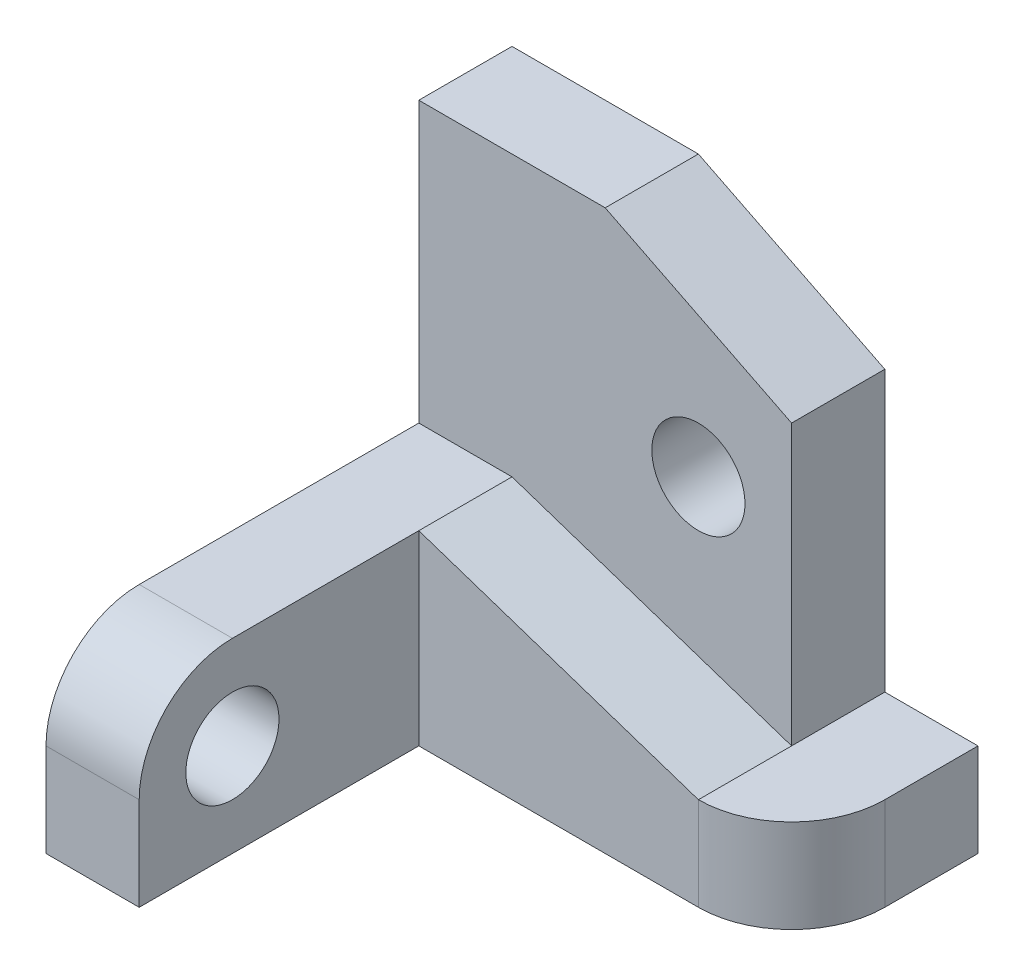
ISO-10303-21;
HEADER;
FILE_DESCRIPTION(('STEP AP214'),'2;1');
FILE_NAME('part.step','',(''),(''),'','','');
FILE_SCHEMA(('AUTOMOTIVE_DESIGN { 1 0 10303 214 1 1 1 1 }'));
ENDSEC;
DATA;
#1=APPLICATION_CONTEXT('core data for automotive mechanical design processes');
#2=APPLICATION_PROTOCOL_DEFINITION('international standard','automotive_design',2000,#1);
#3=PRODUCT_CONTEXT('',#1,'mechanical');
#4=PRODUCT('Part','Part','',(#3));
#5=PRODUCT_RELATED_PRODUCT_CATEGORY('part','',(#4));
#6=PRODUCT_DEFINITION_FORMATION('','',#4);
#7=PRODUCT_DEFINITION_CONTEXT('part definition',#1,'design');
#8=PRODUCT_DEFINITION('design','',#6,#7);
#9=PRODUCT_DEFINITION_SHAPE('','',#8);
#10=(LENGTH_UNIT() NAMED_UNIT(*) SI_UNIT(.MILLI.,.METRE.));
#11=(NAMED_UNIT(*) PLANE_ANGLE_UNIT() SI_UNIT($,.RADIAN.));
#12=(NAMED_UNIT(*) SI_UNIT($,.STERADIAN.) SOLID_ANGLE_UNIT());
#13=UNCERTAINTY_MEASURE_WITH_UNIT(LENGTH_MEASURE(1.E-05),#10,'distance_accuracy_value','');
#14=(GEOMETRIC_REPRESENTATION_CONTEXT(3) GLOBAL_UNCERTAINTY_ASSIGNED_CONTEXT((#13)) GLOBAL_UNIT_ASSIGNED_CONTEXT((#10,
#11,#12)) REPRESENTATION_CONTEXT('',''));
#15=CARTESIAN_POINT('',(0.,0.,0.));
#16=DIRECTION('',(0.,0.,1.));
#17=DIRECTION('',(1.,0.,0.));
#18=AXIS2_PLACEMENT_3D('',#15,#16,#17);
#19=CARTESIAN_POINT('',(11.147352147733,8.88294238199023,-3.26230276211233));
#20=DIRECTION('',(1.,0.,0.));
#21=DIRECTION('',(0.,0.,-1.));
#22=AXIS2_PLACEMENT_3D('',#19,#20,#21);
#23=PLANE('',#22);
#24=DIRECTION('',(0.,-1.,0.));
#25=VECTOR('',#24,1.);
#26=CARTESIAN_POINT('',(11.147352147733,11.8829423819902,-4.26230276211233));
#27=LINE('',#26,#25);
#28=CARTESIAN_POINT('',(11.147352147733,10.8829423819902,-4.26230276211233));
#29=VERTEX_POINT('',#28);
#30=CARTESIAN_POINT('',(11.147352147733,7.88294238199023,-4.26230276211233));
#31=VERTEX_POINT('',#30);
#32=EDGE_CURVE('E197',#29,#31,#27,.T.);
#33=ORIENTED_EDGE('',*,*,#32,.T.);
#34=DIRECTION('',(0.,0.,1.));
#35=VECTOR('',#34,1.);
#36=CARTESIAN_POINT('',(11.147352147733,7.88294238199023,-3.26230276211233));
#37=LINE('',#36,#35);
#38=CARTESIAN_POINT('',(11.147352147733,7.88294238199023,-5.26230276211233));
#39=VERTEX_POINT('',#38);
#40=EDGE_CURVE('E105',#39,#31,#37,.T.);
#41=ORIENTED_EDGE('',*,*,#40,.F.);
#42=DIRECTION('',(0.,-1.,0.));
#43=VECTOR('',#42,1.);
#44=CARTESIAN_POINT('',(11.147352147733,11.8829423819902,-5.26230276211233));
#45=LINE('',#44,#43);
#46=CARTESIAN_POINT('',(11.147352147733,10.8829423819902,-5.26230276211233));
#47=VERTEX_POINT('',#46);
#48=EDGE_CURVE('E228',#47,#39,#45,.T.);
#49=ORIENTED_EDGE('',*,*,#48,.F.);
#50=DIRECTION('',(0.,0.,1.));
#51=VECTOR('',#50,1.);
#52=CARTESIAN_POINT('',(11.147352147733,10.8829423819902,-9.26230276211233));
#53=LINE('',#52,#51);
#54=EDGE_CURVE('E213',#47,#29,#53,.T.);
#55=ORIENTED_EDGE('',*,*,#54,.T.);
#56=EDGE_LOOP('',(#33,#41,#49,#55));
#57=FACE_BOUND('',#56,.T.);
#58=ADVANCED_FACE('F38',(#57),#23,.T.);
#59=CARTESIAN_POINT('',(11.147352147733,7.88294238199023,-4.26230276211233));
#60=DIRECTION('',(0.,-1.,0.));
#61=DIRECTION('',(0.,0.,-1.));
#62=AXIS2_PLACEMENT_3D('',#59,#60,#61);
#63=CYLINDRICAL_SURFACE('',#62,1.);
#64=CARTESIAN_POINT('',(11.147352147733,6.88294238199023,-4.26230276211233));
#65=DIRECTION('',(0.,1.,0.));
#66=DIRECTION('',(0.,0.,1.));
#67=AXIS2_PLACEMENT_3D('',#64,#65,#66);
#68=CIRCLE('',#67,1.);
#69=CARTESIAN_POINT('',(11.147352147733,6.88294238199023,-3.26230276211233));
#70=VERTEX_POINT('',#69);
#71=CARTESIAN_POINT('',(12.147352147733,6.88294238199023,-4.26230276211234));
#72=VERTEX_POINT('',#71);
#73=EDGE_CURVE('E98',#70,#72,#68,.T.);
#74=ORIENTED_EDGE('',*,*,#73,.T.);
#75=DIRECTION('',(0.,-1.,0.));
#76=VECTOR('',#75,1.);
#77=CARTESIAN_POINT('',(12.147352147733,7.88294238199023,-4.26230276211234));
#78=LINE('',#77,#76);
#79=CARTESIAN_POINT('',(12.147352147733,7.88294238199023,-4.26230276211234));
#80=VERTEX_POINT('',#79);
#81=EDGE_CURVE('E89',#80,#72,#78,.T.);
#82=ORIENTED_EDGE('',*,*,#81,.F.);
#83=CARTESIAN_POINT('',(11.147352147733,7.88294238199023,-4.26230276211233));
#84=DIRECTION('',(0.,1.,0.));
#85=DIRECTION('',(0.,0.,1.));
#86=AXIS2_PLACEMENT_3D('',#83,#84,#85);
#87=CIRCLE('',#86,1.);
#88=CARTESIAN_POINT('',(11.147352147733,7.88294238199023,-3.26230276211233));
#89=VERTEX_POINT('',#88);
#90=EDGE_CURVE('E108',#89,#80,#87,.T.);
#91=ORIENTED_EDGE('',*,*,#90,.F.);
#92=DIRECTION('',(0.,-1.,0.));
#93=VECTOR('',#92,1.);
#94=CARTESIAN_POINT('',(11.147352147733,7.88294238199023,-3.26230276211233));
#95=LINE('',#94,#93);
#96=EDGE_CURVE('E46',#89,#70,#95,.T.);
#97=ORIENTED_EDGE('',*,*,#96,.T.);
#98=EDGE_LOOP('',(#74,#82,#91,#97));
#99=FACE_BOUND('',#98,.T.);
#100=ADVANCED_FACE('F40',(#99),#63,.T.);
#101=CARTESIAN_POINT('',(12.147352147733,7.88294238199023,-3.26230276211233));
#102=DIRECTION('',(-1.,0.,0.));
#103=DIRECTION('',(0.,0.,1.));
#104=AXIS2_PLACEMENT_3D('',#101,#102,#103);
#105=PLANE('',#104);
#106=DIRECTION('',(0.,0.,-1.));
#107=VECTOR('',#106,1.);
#108=CARTESIAN_POINT('',(12.147352147733,6.88294238199023,-3.26230276211233));
#109=LINE('',#108,#107);
#110=CARTESIAN_POINT('',(12.147352147733,6.88294238199023,-5.26230276211233));
#111=VERTEX_POINT('',#110);
#112=EDGE_CURVE('E93',#72,#111,#109,.T.);
#113=ORIENTED_EDGE('',*,*,#112,.T.);
#114=DIRECTION('',(0.,-1.,0.));
#115=VECTOR('',#114,1.);
#116=CARTESIAN_POINT('',(12.147352147733,7.88294238199023,-5.26230276211233));
#117=LINE('',#116,#115);
#118=CARTESIAN_POINT('',(12.147352147733,7.88294238199023,-5.26230276211233));
#119=VERTEX_POINT('',#118);
#120=EDGE_CURVE('E77',#119,#111,#117,.T.);
#121=ORIENTED_EDGE('',*,*,#120,.F.);
#122=DIRECTION('',(0.,0.,-1.));
#123=VECTOR('',#122,1.);
#124=CARTESIAN_POINT('',(12.147352147733,7.88294238199023,-3.26230276211233));
#125=LINE('',#124,#123);
#126=EDGE_CURVE('E61',#80,#119,#125,.T.);
#127=ORIENTED_EDGE('',*,*,#126,.F.);
#128=ORIENTED_EDGE('',*,*,#81,.T.);
#129=EDGE_LOOP('',(#113,#121,#127,#128));
#130=FACE_BOUND('',#129,.T.);
#131=ADVANCED_FACE('F94',(#130),#105,.F.);
#132=CARTESIAN_POINT('',(7.14735214773301,7.88294238199023,-5.26230276211233));
#133=DIRECTION('',(0.,0.,-1.));
#134=DIRECTION('',(-1.,0.,0.));
#135=AXIS2_PLACEMENT_3D('',#132,#133,#134);
#136=PLANE('',#135);
#137=DIRECTION('',(-0.894427190999916,0.447213595499958,0.));
#138=VECTOR('',#137,1.);
#139=CARTESIAN_POINT('',(9.14735214773301,11.8829423819902,-5.26230276211233));
#140=LINE('',#139,#138);
#141=CARTESIAN_POINT('',(9.14735214773301,11.8829423819902,-5.26230276211233));
#142=VERTEX_POINT('',#141);
#143=EDGE_CURVE('E52',#47,#142,#140,.T.);
#144=ORIENTED_EDGE('',*,*,#143,.F.);
#145=ORIENTED_EDGE('',*,*,#48,.T.);
#146=DIRECTION('',(1.,0.,0.));
#147=VECTOR('',#146,1.);
#148=CARTESIAN_POINT('',(7.14735214773301,7.88294238199023,-5.26230276211233));
#149=LINE('',#148,#147);
#150=EDGE_CURVE('E87',#39,#119,#149,.T.);
#151=ORIENTED_EDGE('',*,*,#150,.T.);
#152=ORIENTED_EDGE('',*,*,#120,.T.);
#153=DIRECTION('',(1.,0.,0.));
#154=VECTOR('',#153,1.);
#155=CARTESIAN_POINT('',(7.14735214773301,6.88294238199023,-5.26230276211233));
#156=LINE('',#155,#154);
#157=CARTESIAN_POINT('',(7.14735214773301,6.88294238199023,-5.26230276211233));
#158=VERTEX_POINT('',#157);
#159=EDGE_CURVE('E84',#158,#111,#156,.T.);
#160=ORIENTED_EDGE('',*,*,#159,.F.);
#161=DIRECTION('',(0.,-1.,0.));
#162=VECTOR('',#161,1.);
#163=CARTESIAN_POINT('',(7.14735214773301,11.8829423819902,-5.26230276211233));
#164=LINE('',#163,#162);
#165=CARTESIAN_POINT('',(7.14735214773301,11.8829423819902,-5.26230276211233));
#166=VERTEX_POINT('',#165);
#167=EDGE_CURVE('E184',#166,#158,#164,.T.);
#168=ORIENTED_EDGE('',*,*,#167,.F.);
#169=DIRECTION('',(1.,0.,0.));
#170=VECTOR('',#169,1.);
#171=CARTESIAN_POINT('',(7.14735214773301,11.8829423819902,-5.26230276211233));
#172=LINE('',#171,#170);
#173=EDGE_CURVE('E223',#166,#142,#172,.T.);
#174=ORIENTED_EDGE('',*,*,#173,.T.);
#175=EDGE_LOOP('',(#144,#145,#151,#152,#160,#168,#174));
#176=FACE_BOUND('',#175,.T.);
#177=CARTESIAN_POINT('',(10.147352147733,9.88294238199023,-5.26230276211233));
#178=DIRECTION('',(0.,0.,-1.));
#179=DIRECTION('',(-1.,0.,0.));
#180=AXIS2_PLACEMENT_3D('',#177,#178,#179);
#181=CIRCLE('',#180,0.5);
#182=CARTESIAN_POINT('',(9.64735214773301,9.88294238199023,-5.26230276211233));
#183=VERTEX_POINT('',#182);
#184=EDGE_CURVE('E219',#183,#183,#181,.T.);
#185=ORIENTED_EDGE('',*,*,#184,.F.);
#186=EDGE_LOOP('',(#185));
#187=FACE_BOUND('',#186,.T.);
#188=ADVANCED_FACE('F79',(#176,#187),#136,.T.);
#189=CARTESIAN_POINT('',(7.14735214773301,7.88294238199023,-3.26230276211233));
#190=DIRECTION('',(0.,1.,0.));
#191=DIRECTION('',(0.,0.,1.));
#192=AXIS2_PLACEMENT_3D('',#189,#190,#191);
#193=PLANE('',#192);
#194=ORIENTED_EDGE('',*,*,#40,.T.);
#195=DIRECTION('',(0.,0.,1.));
#196=VECTOR('',#195,1.);
#197=CARTESIAN_POINT('',(11.147352147733,7.88294238199023,-7.42458042228071));
#198=LINE('',#197,#196);
#199=EDGE_CURVE('E202',#31,#89,#198,.T.);
#200=ORIENTED_EDGE('',*,*,#199,.T.);
#201=ORIENTED_EDGE('',*,*,#90,.T.);
#202=ORIENTED_EDGE('',*,*,#126,.T.);
#203=ORIENTED_EDGE('',*,*,#150,.F.);
#204=EDGE_LOOP('',(#194,#200,#201,#202,#203));
#205=FACE_BOUND('',#204,.T.);
#206=ADVANCED_FACE('F201',(#205),#193,.T.);
#207=CARTESIAN_POINT('',(7.14735214773301,6.88294238199023,-3.26230276211233));
#208=DIRECTION('',(0.,1.,0.));
#209=DIRECTION('',(0.,0.,1.));
#210=AXIS2_PLACEMENT_3D('',#207,#208,#209);
#211=PLANE('',#210);
#212=DIRECTION('',(0.,0.,-1.));
#213=VECTOR('',#212,1.);
#214=CARTESIAN_POINT('',(7.14735214773301,6.88294238199023,-3.26230276211233));
#215=LINE('',#214,#213);
#216=CARTESIAN_POINT('',(7.14735214773301,6.88294238199023,-0.262302762112331));
#217=VERTEX_POINT('',#216);
#218=EDGE_CURVE('E103',#217,#158,#215,.T.);
#219=ORIENTED_EDGE('',*,*,#218,.T.);
#220=ORIENTED_EDGE('',*,*,#159,.T.);
#221=ORIENTED_EDGE('',*,*,#112,.F.);
#222=ORIENTED_EDGE('',*,*,#73,.F.);
#223=DIRECTION('',(1.,0.,0.));
#224=VECTOR('',#223,1.);
#225=CARTESIAN_POINT('',(7.14735214773301,6.88294238199023,-3.26230276211233));
#226=LINE('',#225,#224);
#227=CARTESIAN_POINT('',(8.14735214773301,6.88294238199023,-3.26230276211233));
#228=VERTEX_POINT('',#227);
#229=EDGE_CURVE('E125',#228,#70,#226,.T.);
#230=ORIENTED_EDGE('',*,*,#229,.F.);
#231=DIRECTION('',(0.,0.,-1.));
#232=VECTOR('',#231,1.);
#233=CARTESIAN_POINT('',(8.14735214773301,6.88294238199023,-0.262302762112331));
#234=LINE('',#233,#232);
#235=CARTESIAN_POINT('',(8.14735214773301,6.88294238199023,-0.262302762112331));
#236=VERTEX_POINT('',#235);
#237=EDGE_CURVE('E383',#236,#228,#234,.T.);
#238=ORIENTED_EDGE('',*,*,#237,.F.);
#239=DIRECTION('',(-1.,0.,0.));
#240=VECTOR('',#239,1.);
#241=CARTESIAN_POINT('',(8.14735214773301,6.88294238199023,-0.262302762112331));
#242=LINE('',#241,#240);
#243=EDGE_CURVE('E386',#236,#217,#242,.T.);
#244=ORIENTED_EDGE('',*,*,#243,.T.);
#245=EDGE_LOOP('',(#219,#220,#221,#222,#230,#238,#244));
#246=FACE_BOUND('',#245,.T.);
#247=ADVANCED_FACE('F100',(#246),#211,.F.);
#248=CARTESIAN_POINT('',(7.14735214773301,8.88294238199023,-3.26230276211233));
#249=DIRECTION('',(-1.,0.,0.));
#250=DIRECTION('',(0.,0.,1.));
#251=AXIS2_PLACEMENT_3D('',#248,#249,#250);
#252=PLANE('',#251);
#253=ORIENTED_EDGE('',*,*,#218,.F.);
#254=DIRECTION('',(0.,-1.,0.));
#255=VECTOR('',#254,1.);
#256=CARTESIAN_POINT('',(7.14735214773301,7.88294238199022,-0.262302762112331));
#257=LINE('',#256,#255);
#258=CARTESIAN_POINT('',(7.14735214773301,7.88294238199022,-0.262302762112331));
#259=VERTEX_POINT('',#258);
#260=EDGE_CURVE('E374',#259,#217,#257,.T.);
#261=ORIENTED_EDGE('',*,*,#260,.F.);
#262=CARTESIAN_POINT('',(7.14735214773301,7.88294238199023,-1.26230276211233));
#263=DIRECTION('',(1.,0.,0.));
#264=DIRECTION('',(0.,0.,-1.));
#265=AXIS2_PLACEMENT_3D('',#262,#263,#264);
#266=CIRCLE('',#265,1.);
#267=CARTESIAN_POINT('',(7.14735214773301,8.88294238199023,-1.26230276211234));
#268=VERTEX_POINT('',#267);
#269=EDGE_CURVE('E192',#268,#259,#266,.T.);
#270=ORIENTED_EDGE('',*,*,#269,.F.);
#271=DIRECTION('',(0.,0.,-1.));
#272=VECTOR('',#271,1.);
#273=CARTESIAN_POINT('',(7.14735214773301,8.88294238199023,-3.26230276211233));
#274=LINE('',#273,#272);
#275=CARTESIAN_POINT('',(7.14735214773301,8.88294238199023,-4.26230276211233));
#276=VERTEX_POINT('',#275);
#277=EDGE_CURVE('E167',#268,#276,#274,.T.);
#278=ORIENTED_EDGE('',*,*,#277,.T.);
#279=DIRECTION('',(0.,-1.,0.));
#280=VECTOR('',#279,1.);
#281=CARTESIAN_POINT('',(7.14735214773301,11.8829423819902,-4.26230276211233));
#282=LINE('',#281,#280);
#283=CARTESIAN_POINT('',(7.14735214773301,11.8829423819902,-4.26230276211233));
#284=VERTEX_POINT('',#283);
#285=EDGE_CURVE('E175',#284,#276,#282,.T.);
#286=ORIENTED_EDGE('',*,*,#285,.F.);
#287=DIRECTION('',(0.,0.,-1.));
#288=VECTOR('',#287,1.);
#289=CARTESIAN_POINT('',(7.14735214773301,11.8829423819902,-3.26230276211233));
#290=LINE('',#289,#288);
#291=EDGE_CURVE('E185',#284,#166,#290,.T.);
#292=ORIENTED_EDGE('',*,*,#291,.T.);
#293=ORIENTED_EDGE('',*,*,#167,.T.);
#294=EDGE_LOOP('',(#253,#261,#270,#278,#286,#292,#293));
#295=FACE_BOUND('',#294,.T.);
#296=CARTESIAN_POINT('',(7.14735214773301,7.88294238199023,-1.26230276211233));
#297=DIRECTION('',(1.,0.,0.));
#298=DIRECTION('',(0.,0.,-1.));
#299=AXIS2_PLACEMENT_3D('',#296,#297,#298);
#300=CIRCLE('',#299,0.5);
#301=CARTESIAN_POINT('',(7.14735214773301,7.88294238199023,-1.76230276211233));
#302=VERTEX_POINT('',#301);
#303=EDGE_CURVE('E367',#302,#302,#300,.T.);
#304=ORIENTED_EDGE('',*,*,#303,.T.);
#305=EDGE_LOOP('',(#304));
#306=FACE_BOUND('',#305,.T.);
#307=ADVANCED_FACE('F188',(#295,#306),#252,.T.);
#308=CARTESIAN_POINT('',(7.14735214773301,8.88294238199023,-3.26230276211233));
#309=DIRECTION('',(0.,0.,-1.));
#310=DIRECTION('',(-1.,0.,0.));
#311=AXIS2_PLACEMENT_3D('',#308,#309,#310);
#312=PLANE('',#311);
#313=DIRECTION('',(0.948683298050514,-0.316227766016838,0.));
#314=VECTOR('',#313,1.);
#315=CARTESIAN_POINT('',(11.147352147733,7.88294238199023,-3.26230276211233));
#316=LINE('',#315,#314);
#317=CARTESIAN_POINT('',(8.14735214773301,8.88294238199023,-3.26230276211233));
#318=VERTEX_POINT('',#317);
#319=EDGE_CURVE('E123',#318,#89,#316,.T.);
#320=ORIENTED_EDGE('',*,*,#319,.F.);
#321=DIRECTION('',(0.,1.,0.));
#322=VECTOR('',#321,1.);
#323=CARTESIAN_POINT('',(8.14735214773301,8.88294238199023,-3.26230276211233));
#324=LINE('',#323,#322);
#325=EDGE_CURVE('E371',#228,#318,#324,.T.);
#326=ORIENTED_EDGE('',*,*,#325,.F.);
#327=ORIENTED_EDGE('',*,*,#229,.T.);
#328=ORIENTED_EDGE('',*,*,#96,.F.);
#329=EDGE_LOOP('',(#320,#326,#327,#328));
#330=FACE_BOUND('',#329,.T.);
#331=ADVANCED_FACE('F119',(#330),#312,.F.);
#332=CARTESIAN_POINT('',(7.14735214773301,8.88294238199023,-3.26230276211233));
#333=DIRECTION('',(0.,1.,0.));
#334=DIRECTION('',(0.,0.,1.));
#335=AXIS2_PLACEMENT_3D('',#332,#333,#334);
#336=PLANE('',#335);
#337=DIRECTION('',(0.,0.,1.));
#338=VECTOR('',#337,1.);
#339=CARTESIAN_POINT('',(8.14735214773301,8.88294238199023,-7.42458042228071));
#340=LINE('',#339,#338);
#341=CARTESIAN_POINT('',(8.14735214773301,8.88294238199023,-4.26230276211233));
#342=VERTEX_POINT('',#341);
#343=EDGE_CURVE('E170',#342,#318,#340,.T.);
#344=ORIENTED_EDGE('',*,*,#343,.F.);
#345=DIRECTION('',(-1.,0.,0.));
#346=VECTOR('',#345,1.);
#347=CARTESIAN_POINT('',(7.14735214773301,8.88294238199023,-4.26230276211233));
#348=LINE('',#347,#346);
#349=EDGE_CURVE('E161',#342,#276,#348,.T.);
#350=ORIENTED_EDGE('',*,*,#349,.T.);
#351=ORIENTED_EDGE('',*,*,#277,.F.);
#352=DIRECTION('',(-1.,0.,0.));
#353=VECTOR('',#352,1.);
#354=CARTESIAN_POINT('',(8.14735214773301,8.88294238199023,-1.26230276211234));
#355=LINE('',#354,#353);
#356=CARTESIAN_POINT('',(8.14735214773301,8.88294238199023,-1.26230276211234));
#357=VERTEX_POINT('',#356);
#358=EDGE_CURVE('E394',#357,#268,#355,.T.);
#359=ORIENTED_EDGE('',*,*,#358,.F.);
#360=DIRECTION('',(0.,0.,1.));
#361=VECTOR('',#360,1.);
#362=CARTESIAN_POINT('',(8.14735214773301,8.88294238199023,-3.26230276211233));
#363=LINE('',#362,#361);
#364=EDGE_CURVE('E373',#318,#357,#363,.T.);
#365=ORIENTED_EDGE('',*,*,#364,.F.);
#366=EDGE_LOOP('',(#344,#350,#351,#359,#365));
#367=FACE_BOUND('',#366,.T.);
#368=ADVANCED_FACE('F163',(#367),#336,.T.);
#369=CARTESIAN_POINT('',(7.14735214773301,11.8829423819902,-4.26230276211233));
#370=DIRECTION('',(0.,0.,1.));
#371=DIRECTION('',(1.,0.,0.));
#372=AXIS2_PLACEMENT_3D('',#369,#370,#371);
#373=PLANE('',#372);
#374=DIRECTION('',(0.894427190999916,-0.447213595499958,0.));
#375=VECTOR('',#374,1.);
#376=CARTESIAN_POINT('',(9.14735214773301,11.8829423819902,-4.26230276211233));
#377=LINE('',#376,#375);
#378=CARTESIAN_POINT('',(9.14735214773301,11.8829423819902,-4.26230276211233));
#379=VERTEX_POINT('',#378);
#380=EDGE_CURVE('E211',#379,#29,#377,.T.);
#381=ORIENTED_EDGE('',*,*,#380,.F.);
#382=DIRECTION('',(-1.,0.,0.));
#383=VECTOR('',#382,1.);
#384=CARTESIAN_POINT('',(7.14735214773301,11.8829423819902,-4.26230276211233));
#385=LINE('',#384,#383);
#386=EDGE_CURVE('E180',#379,#284,#385,.T.);
#387=ORIENTED_EDGE('',*,*,#386,.T.);
#388=ORIENTED_EDGE('',*,*,#285,.T.);
#389=ORIENTED_EDGE('',*,*,#349,.F.);
#390=DIRECTION('',(-0.948683298050514,0.316227766016838,0.));
#391=VECTOR('',#390,1.);
#392=CARTESIAN_POINT('',(11.147352147733,7.88294238199023,-4.26230276211233));
#393=LINE('',#392,#391);
#394=EDGE_CURVE('E204',#31,#342,#393,.T.);
#395=ORIENTED_EDGE('',*,*,#394,.F.);
#396=ORIENTED_EDGE('',*,*,#32,.F.);
#397=EDGE_LOOP('',(#381,#387,#388,#389,#395,#396));
#398=FACE_BOUND('',#397,.T.);
#399=CARTESIAN_POINT('',(10.147352147733,9.88294238199023,-4.26230276211233));
#400=DIRECTION('',(0.,0.,1.));
#401=DIRECTION('',(1.,0.,0.));
#402=AXIS2_PLACEMENT_3D('',#399,#400,#401);
#403=CIRCLE('',#402,0.5);
#404=CARTESIAN_POINT('',(10.647352147733,9.88294238199023,-4.26230276211233));
#405=VERTEX_POINT('',#404);
#406=EDGE_CURVE('E206',#405,#405,#403,.T.);
#407=ORIENTED_EDGE('',*,*,#406,.F.);
#408=EDGE_LOOP('',(#407));
#409=FACE_BOUND('',#408,.T.);
#410=ADVANCED_FACE('F177',(#398,#409),#373,.T.);
#411=CARTESIAN_POINT('',(7.14735214773301,11.8829423819902,-3.26230276211233));
#412=DIRECTION('',(0.,1.,0.));
#413=DIRECTION('',(0.,0.,1.));
#414=AXIS2_PLACEMENT_3D('',#411,#412,#413);
#415=PLANE('',#414);
#416=DIRECTION('',(0.,0.,1.));
#417=VECTOR('',#416,1.);
#418=CARTESIAN_POINT('',(9.14735214773301,11.8829423819902,-3.26230276211233));
#419=LINE('',#418,#417);
#420=EDGE_CURVE('E11',#142,#379,#419,.T.);
#421=ORIENTED_EDGE('',*,*,#420,.F.);
#422=ORIENTED_EDGE('',*,*,#173,.F.);
#423=ORIENTED_EDGE('',*,*,#291,.F.);
#424=ORIENTED_EDGE('',*,*,#386,.F.);
#425=EDGE_LOOP('',(#421,#422,#423,#424));
#426=FACE_BOUND('',#425,.T.);
#427=ADVANCED_FACE('F301',(#426),#415,.T.);
#428=CARTESIAN_POINT('',(9.14735214773301,11.8829423819902,-9.26230276211233));
#429=DIRECTION('',(-0.447213595499958,-0.894427190999916,0.));
#430=DIRECTION('',(0.894427190999916,-0.447213595499958,0.));
#431=AXIS2_PLACEMENT_3D('',#428,#429,#430);
#432=PLANE('',#431);
#433=ORIENTED_EDGE('',*,*,#143,.T.);
#434=ORIENTED_EDGE('',*,*,#420,.T.);
#435=ORIENTED_EDGE('',*,*,#380,.T.);
#436=ORIENTED_EDGE('',*,*,#54,.F.);
#437=EDGE_LOOP('',(#433,#434,#435,#436));
#438=FACE_BOUND('',#437,.T.);
#439=ADVANCED_FACE('F244',(#438),#432,.F.);
#440=CARTESIAN_POINT('',(10.147352147733,9.88294238199023,-9.26230276211233));
#441=DIRECTION('',(0.,0.,1.));
#442=DIRECTION('',(1.,0.,0.));
#443=AXIS2_PLACEMENT_3D('',#440,#441,#442);
#444=CYLINDRICAL_SURFACE('',#443,0.5);
#445=ORIENTED_EDGE('',*,*,#184,.T.);
#446=EDGE_LOOP('',(#445));
#447=FACE_BOUND('',#446,.T.);
#448=ORIENTED_EDGE('',*,*,#406,.T.);
#449=EDGE_LOOP('',(#448));
#450=FACE_BOUND('',#449,.T.);
#451=ADVANCED_FACE('F235',(#447,#450),#444,.F.);
#452=CARTESIAN_POINT('',(11.147352147733,7.88294238199023,-7.42458042228071));
#453=DIRECTION('',(-0.316227766016838,-0.948683298050514,0.));
#454=DIRECTION('',(0.948683298050514,-0.316227766016838,0.));
#455=AXIS2_PLACEMENT_3D('',#452,#453,#454);
#456=PLANE('',#455);
#457=ORIENTED_EDGE('',*,*,#394,.T.);
#458=ORIENTED_EDGE('',*,*,#343,.T.);
#459=ORIENTED_EDGE('',*,*,#319,.T.);
#460=ORIENTED_EDGE('',*,*,#199,.F.);
#461=EDGE_LOOP('',(#457,#458,#459,#460));
#462=FACE_BOUND('',#461,.T.);
#463=ADVANCED_FACE('F232',(#462),#456,.F.);
#464=CARTESIAN_POINT('',(8.14735214773301,7.88294238199023,-1.26230276211233));
#465=DIRECTION('',(1.,0.,0.));
#466=DIRECTION('',(0.,0.,-1.));
#467=AXIS2_PLACEMENT_3D('',#464,#465,#466);
#468=PLANE('',#467);
#469=ORIENTED_EDGE('',*,*,#325,.T.);
#470=ORIENTED_EDGE('',*,*,#364,.T.);
#471=CARTESIAN_POINT('',(8.14735214773301,7.88294238199023,-1.26230276211233));
#472=DIRECTION('',(1.,0.,0.));
#473=DIRECTION('',(0.,0.,-1.));
#474=AXIS2_PLACEMENT_3D('',#471,#472,#473);
#475=CIRCLE('',#474,1.);
#476=CARTESIAN_POINT('',(8.14735214773301,7.88294238199022,-0.262302762112331));
#477=VERTEX_POINT('',#476);
#478=EDGE_CURVE('E377',#357,#477,#475,.T.);
#479=ORIENTED_EDGE('',*,*,#478,.T.);
#480=DIRECTION('',(0.,-1.,0.));
#481=VECTOR('',#480,1.);
#482=CARTESIAN_POINT('',(8.14735214773301,7.88294238199022,-0.262302762112331));
#483=LINE('',#482,#481);
#484=EDGE_CURVE('E380',#477,#236,#483,.T.);
#485=ORIENTED_EDGE('',*,*,#484,.T.);
#486=ORIENTED_EDGE('',*,*,#237,.T.);
#487=EDGE_LOOP('',(#469,#470,#479,#485,#486));
#488=FACE_BOUND('',#487,.T.);
#489=CARTESIAN_POINT('',(8.14735214773301,7.88294238199023,-1.26230276211233));
#490=DIRECTION('',(1.,0.,0.));
#491=DIRECTION('',(0.,0.,-1.));
#492=AXIS2_PLACEMENT_3D('',#489,#490,#491);
#493=CIRCLE('',#492,0.5);
#494=CARTESIAN_POINT('',(8.14735214773301,7.88294238199023,-1.76230276211233));
#495=VERTEX_POINT('',#494);
#496=EDGE_CURVE('E364',#495,#495,#493,.T.);
#497=ORIENTED_EDGE('',*,*,#496,.F.);
#498=EDGE_LOOP('',(#497));
#499=FACE_BOUND('',#498,.T.);
#500=ADVANCED_FACE('F234',(#488,#499),#468,.T.);
#501=CARTESIAN_POINT('',(8.14735214773301,7.88294238199023,-1.26230276211233));
#502=DIRECTION('',(-1.,0.,0.));
#503=DIRECTION('',(0.,0.,1.));
#504=AXIS2_PLACEMENT_3D('',#501,#502,#503);
#505=CYLINDRICAL_SURFACE('',#504,1.);
#506=ORIENTED_EDGE('',*,*,#269,.T.);
#507=DIRECTION('',(-1.,0.,0.));
#508=VECTOR('',#507,1.);
#509=CARTESIAN_POINT('',(8.14735214773301,7.88294238199022,-0.262302762112331));
#510=LINE('',#509,#508);
#511=EDGE_CURVE('E391',#477,#259,#510,.T.);
#512=ORIENTED_EDGE('',*,*,#511,.F.);
#513=ORIENTED_EDGE('',*,*,#478,.F.);
#514=ORIENTED_EDGE('',*,*,#358,.T.);
#515=EDGE_LOOP('',(#506,#512,#513,#514));
#516=FACE_BOUND('',#515,.T.);
#517=ADVANCED_FACE('F241',(#516),#505,.T.);
#518=CARTESIAN_POINT('',(8.14735214773301,7.88294238199022,-0.262302762112331));
#519=DIRECTION('',(0.,0.,-1.));
#520=DIRECTION('',(-1.,0.,0.));
#521=AXIS2_PLACEMENT_3D('',#518,#519,#520);
#522=PLANE('',#521);
#523=ORIENTED_EDGE('',*,*,#260,.T.);
#524=ORIENTED_EDGE('',*,*,#243,.F.);
#525=ORIENTED_EDGE('',*,*,#484,.F.);
#526=ORIENTED_EDGE('',*,*,#511,.T.);
#527=EDGE_LOOP('',(#523,#524,#525,#526));
#528=FACE_BOUND('',#527,.T.);
#529=ADVANCED_FACE('F338',(#528),#522,.F.);
#530=CARTESIAN_POINT('',(8.14735214773301,7.88294238199023,-1.26230276211233));
#531=DIRECTION('',(-1.,0.,0.));
#532=DIRECTION('',(0.,0.,1.));
#533=AXIS2_PLACEMENT_3D('',#530,#531,#532);
#534=CYLINDRICAL_SURFACE('',#533,0.5);
#535=ORIENTED_EDGE('',*,*,#496,.T.);
#536=EDGE_LOOP('',(#535));
#537=FACE_BOUND('',#536,.T.);
#538=ORIENTED_EDGE('',*,*,#303,.F.);
#539=EDGE_LOOP('',(#538));
#540=FACE_BOUND('',#539,.T.);
#541=ADVANCED_FACE('F347',(#537,#540),#534,.F.);
#542=CLOSED_SHELL('',(#58,#100,#131,#188,#206,#247,#307,#331,#368,#410,#427,#439,#451,#463,#500,
#517,#529,#541));
#543=MANIFOLD_SOLID_BREP('B2',#542);
#544=ADVANCED_BREP_SHAPE_REPRESENTATION('',(#18,#543),#14);
#545=SHAPE_DEFINITION_REPRESENTATION(#9,#544);
ENDSEC;
END-ISO-10303-21;
